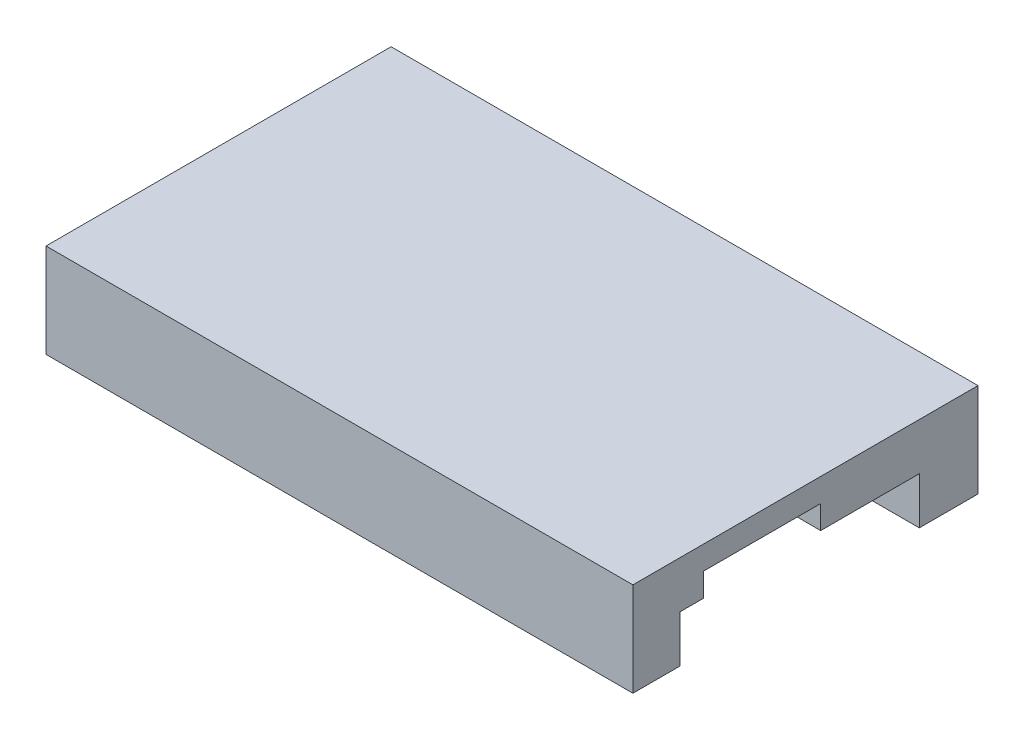
ISO-10303-21;
HEADER;
FILE_DESCRIPTION(('STEP AP214'),'2;1');
FILE_NAME('part.step','',(''),(''),'','','');
FILE_SCHEMA(('AUTOMOTIVE_DESIGN { 1 0 10303 214 1 1 1 1 }'));
ENDSEC;
DATA;
#1=APPLICATION_CONTEXT('core data for automotive mechanical design processes');
#2=APPLICATION_PROTOCOL_DEFINITION('international standard','automotive_design',2000,#1);
#3=PRODUCT_CONTEXT('',#1,'mechanical');
#4=PRODUCT('Part','Part','',(#3));
#5=PRODUCT_RELATED_PRODUCT_CATEGORY('part','',(#4));
#6=PRODUCT_DEFINITION_FORMATION('','',#4);
#7=PRODUCT_DEFINITION_CONTEXT('part definition',#1,'design');
#8=PRODUCT_DEFINITION('design','',#6,#7);
#9=PRODUCT_DEFINITION_SHAPE('','',#8);
#10=(LENGTH_UNIT() NAMED_UNIT(*) SI_UNIT(.MILLI.,.METRE.));
#11=(NAMED_UNIT(*) PLANE_ANGLE_UNIT() SI_UNIT($,.RADIAN.));
#12=(NAMED_UNIT(*) SI_UNIT($,.STERADIAN.) SOLID_ANGLE_UNIT());
#13=UNCERTAINTY_MEASURE_WITH_UNIT(LENGTH_MEASURE(1.E-05),#10,'distance_accuracy_value','');
#14=(GEOMETRIC_REPRESENTATION_CONTEXT(3) GLOBAL_UNCERTAINTY_ASSIGNED_CONTEXT((#13)) GLOBAL_UNIT_ASSIGNED_CONTEXT((#10,
#11,#12)) REPRESENTATION_CONTEXT('',''));
#15=CARTESIAN_POINT('',(0.,0.,0.));
#16=DIRECTION('',(0.,0.,1.));
#17=DIRECTION('',(1.,0.,0.));
#18=AXIS2_PLACEMENT_3D('',#15,#16,#17);
#19=CARTESIAN_POINT('',(0.,-1.,0.));
#20=DIRECTION('',(0.,-1.,0.));
#21=DIRECTION('',(0.,0.,-1.));
#22=AXIS2_PLACEMENT_3D('',#19,#20,#21);
#23=PLANE('',#22);
#24=DIRECTION('',(0.,0.,-1.));
#25=VECTOR('',#24,1.);
#26=CARTESIAN_POINT('',(-19.9854887738261,-1.,0.));
#27=LINE('',#26,#25);
#28=CARTESIAN_POINT('',(-19.9854887738261,-1.,-7.25654754169675));
#29=VERTEX_POINT('',#28);
#30=CARTESIAN_POINT('',(-19.9854887738261,-1.,-8.25654754169675));
#31=VERTEX_POINT('',#30);
#32=EDGE_CURVE('E276',#29,#31,#27,.T.);
#33=ORIENTED_EDGE('',*,*,#32,.F.);
#34=DIRECTION('',(1.,0.,0.));
#35=VECTOR('',#34,1.);
#36=CARTESIAN_POINT('',(0.,-1.,-7.25654754169675));
#37=LINE('',#36,#35);
#38=CARTESIAN_POINT('',(-42.4854887738261,-1.,-7.25654754169675));
#39=VERTEX_POINT('',#38);
#40=EDGE_CURVE('E242',#39,#29,#37,.T.);
#41=ORIENTED_EDGE('',*,*,#40,.F.);
#42=DIRECTION('',(0.,0.,-1.));
#43=VECTOR('',#42,1.);
#44=CARTESIAN_POINT('',(-42.4854887738261,-1.,0.));
#45=LINE('',#44,#43);
#46=CARTESIAN_POINT('',(-42.4854887738261,-1.,-7.75654754169675));
#47=VERTEX_POINT('',#46);
#48=EDGE_CURVE('E327',#39,#47,#45,.T.);
#49=ORIENTED_EDGE('',*,*,#48,.T.);
#50=DIRECTION('',(1.,0.,0.));
#51=VECTOR('',#50,1.);
#52=CARTESIAN_POINT('',(0.,-1.,-7.75654754169675));
#53=LINE('',#52,#51);
#54=CARTESIAN_POINT('',(-20.4854887738261,-1.,-7.75654754169675));
#55=VERTEX_POINT('',#54);
#56=EDGE_CURVE('E324',#47,#55,#53,.T.);
#57=ORIENTED_EDGE('',*,*,#56,.T.);
#58=DIRECTION('',(0.,0.,-1.));
#59=VECTOR('',#58,1.);
#60=CARTESIAN_POINT('',(-20.4854887738261,-1.,0.));
#61=LINE('',#60,#59);
#62=CARTESIAN_POINT('',(-20.4854887738261,-1.,-8.25654754169675));
#63=VERTEX_POINT('',#62);
#64=EDGE_CURVE('E347',#55,#63,#61,.T.);
#65=ORIENTED_EDGE('',*,*,#64,.T.);
#66=DIRECTION('',(-1.,0.,0.));
#67=VECTOR('',#66,1.);
#68=CARTESIAN_POINT('',(0.,-1.,-8.25654754169675));
#69=LINE('',#68,#67);
#70=EDGE_CURVE('E350',#31,#63,#69,.T.);
#71=ORIENTED_EDGE('',*,*,#70,.F.);
#72=EDGE_LOOP('',(#33,#41,#49,#57,#65,#71));
#73=FACE_BOUND('',#72,.T.);
#74=ADVANCED_FACE('F59',(#73),#23,.T.);
#75=CARTESIAN_POINT('',(0.,0.,0.));
#76=DIRECTION('',(0.,1.,0.));
#77=DIRECTION('',(0.,0.,1.));
#78=AXIS2_PLACEMENT_3D('',#75,#76,#77);
#79=PLANE('',#78);
#80=DIRECTION('',(1.,0.,0.));
#81=VECTOR('',#80,1.);
#82=CARTESIAN_POINT('',(0.,0.,-7.75654754169675));
#83=LINE('',#82,#81);
#84=CARTESIAN_POINT('',(-42.4854887738261,0.,-7.75654754169675));
#85=VERTEX_POINT('',#84);
#86=CARTESIAN_POINT('',(-20.4854887738261,0.,-7.75654754169675));
#87=VERTEX_POINT('',#86);
#88=EDGE_CURVE('E331',#85,#87,#83,.T.);
#89=ORIENTED_EDGE('',*,*,#88,.F.);
#90=DIRECTION('',(0.,0.,1.));
#91=VECTOR('',#90,1.);
#92=CARTESIAN_POINT('',(-42.4854887738261,0.,-20.9565475416968));
#93=LINE('',#92,#91);
#94=CARTESIAN_POINT('',(-42.4854887738261,0.,-10.9565475416967));
#95=VERTEX_POINT('',#94);
#96=EDGE_CURVE('E436',#95,#85,#93,.T.);
#97=ORIENTED_EDGE('',*,*,#96,.F.);
#98=DIRECTION('',(1.,0.,0.));
#99=VECTOR('',#98,1.);
#100=CARTESIAN_POINT('',(-42.4854887738261,0.,-10.9565475416967));
#101=LINE('',#100,#99);
#102=CARTESIAN_POINT('',(-37.4854887738261,0.,-10.9565475416967));
#103=VERTEX_POINT('',#102);
#104=EDGE_CURVE('E414',#95,#103,#101,.T.);
#105=ORIENTED_EDGE('',*,*,#104,.T.);
#106=DIRECTION('',(0.,0.,-1.));
#107=VECTOR('',#106,1.);
#108=CARTESIAN_POINT('',(-37.4854887738261,0.,-18.2565475416967));
#109=LINE('',#108,#107);
#110=CARTESIAN_POINT('',(-37.4854887738261,0.,-18.2565475416967));
#111=VERTEX_POINT('',#110);
#112=EDGE_CURVE('E417',#103,#111,#109,.T.);
#113=ORIENTED_EDGE('',*,*,#112,.T.);
#114=DIRECTION('',(-1.,0.,0.));
#115=VECTOR('',#114,1.);
#116=CARTESIAN_POINT('',(-42.4854887738261,0.,-18.2565475416967));
#117=LINE('',#116,#115);
#118=CARTESIAN_POINT('',(-42.4854887738261,0.,-18.2565475416967));
#119=VERTEX_POINT('',#118);
#120=EDGE_CURVE('E393',#111,#119,#117,.T.);
#121=ORIENTED_EDGE('',*,*,#120,.T.);
#122=CARTESIAN_POINT('',(-42.4854887738261,0.,-19.4565475416967));
#123=VERTEX_POINT('',#122);
#124=EDGE_CURVE('E440',#123,#119,#93,.T.);
#125=ORIENTED_EDGE('',*,*,#124,.F.);
#126=DIRECTION('',(1.,0.,0.));
#127=VECTOR('',#126,1.);
#128=CARTESIAN_POINT('',(0.,0.,-19.4565475416967));
#129=LINE('',#128,#127);
#130=CARTESIAN_POINT('',(-20.4854887738261,0.,-19.4565475416967));
#131=VERTEX_POINT('',#130);
#132=EDGE_CURVE('E372',#123,#131,#129,.T.);
#133=ORIENTED_EDGE('',*,*,#132,.T.);
#134=DIRECTION('',(0.,0.,1.));
#135=VECTOR('',#134,1.);
#136=CARTESIAN_POINT('',(-20.4854887738261,0.,0.));
#137=LINE('',#136,#135);
#138=CARTESIAN_POINT('',(-20.4854887738261,0.,-18.4565475416968));
#139=VERTEX_POINT('',#138);
#140=EDGE_CURVE('E343',#131,#139,#137,.T.);
#141=ORIENTED_EDGE('',*,*,#140,.T.);
#142=DIRECTION('',(-1.,0.,0.));
#143=VECTOR('',#142,1.);
#144=CARTESIAN_POINT('',(0.,0.,-18.4565475416968));
#145=LINE('',#144,#143);
#146=CARTESIAN_POINT('',(-17.4854887738261,0.,-18.4565475416968));
#147=VERTEX_POINT('',#146);
#148=EDGE_CURVE('E363',#147,#139,#145,.T.);
#149=ORIENTED_EDGE('',*,*,#148,.F.);
#150=DIRECTION('',(0.,0.,-1.));
#151=VECTOR('',#150,1.);
#152=CARTESIAN_POINT('',(-17.4854887738261,0.,-20.9565475416968));
#153=LINE('',#152,#151);
#154=CARTESIAN_POINT('',(-17.4854887738261,0.,-14.2565475416967));
#155=VERTEX_POINT('',#154);
#156=EDGE_CURVE('E455',#155,#147,#153,.T.);
#157=ORIENTED_EDGE('',*,*,#156,.F.);
#158=DIRECTION('',(-1.,0.,0.));
#159=VECTOR('',#158,1.);
#160=CARTESIAN_POINT('',(-17.4854887738261,0.,-14.2565475416967));
#161=LINE('',#160,#159);
#162=CARTESIAN_POINT('',(-24.9854887738261,0.,-14.2565475416967));
#163=VERTEX_POINT('',#162);
#164=EDGE_CURVE('E400',#155,#163,#161,.T.);
#165=ORIENTED_EDGE('',*,*,#164,.T.);
#166=DIRECTION('',(0.,0.,1.));
#167=VECTOR('',#166,1.);
#168=CARTESIAN_POINT('',(-24.9854887738261,0.,-14.2565475416967));
#169=LINE('',#168,#167);
#170=CARTESIAN_POINT('',(-24.9854887738261,0.,-9.25654754169675));
#171=VERTEX_POINT('',#170);
#172=EDGE_CURVE('E490',#163,#171,#169,.T.);
#173=ORIENTED_EDGE('',*,*,#172,.T.);
#174=DIRECTION('',(1.,0.,0.));
#175=VECTOR('',#174,1.);
#176=CARTESIAN_POINT('',(-17.4854887738261,0.,-9.25654754169675));
#177=LINE('',#176,#175);
#178=CARTESIAN_POINT('',(-17.4854887738261,0.,-9.25654754169675));
#179=VERTEX_POINT('',#178);
#180=EDGE_CURVE('E492',#171,#179,#177,.T.);
#181=ORIENTED_EDGE('',*,*,#180,.T.);
#182=CARTESIAN_POINT('',(-17.4854887738261,0.,-8.25654754169675));
#183=VERTEX_POINT('',#182);
#184=EDGE_CURVE('E450',#183,#179,#153,.T.);
#185=ORIENTED_EDGE('',*,*,#184,.F.);
#186=DIRECTION('',(-1.,0.,0.));
#187=VECTOR('',#186,1.);
#188=CARTESIAN_POINT('',(0.,0.,-8.25654754169675));
#189=LINE('',#188,#187);
#190=CARTESIAN_POINT('',(-20.4854887738261,0.,-8.25654754169675));
#191=VERTEX_POINT('',#190);
#192=EDGE_CURVE('E344',#183,#191,#189,.T.);
#193=ORIENTED_EDGE('',*,*,#192,.T.);
#194=DIRECTION('',(0.,0.,-1.));
#195=VECTOR('',#194,1.);
#196=CARTESIAN_POINT('',(-20.4854887738261,0.,0.));
#197=LINE('',#196,#195);
#198=EDGE_CURVE('E340',#87,#191,#197,.T.);
#199=ORIENTED_EDGE('',*,*,#198,.F.);
#200=EDGE_LOOP('',(#89,#97,#105,#113,#121,#125,#133,#141,#149,#157,#165,#173,#181,#185,#193,#199));
#201=FACE_BOUND('',#200,.T.);
#202=ADVANCED_FACE('F479',(#201),#79,.F.);
#203=CARTESIAN_POINT('',(-42.4854887738261,1.,-20.9565475416968));
#204=DIRECTION('',(1.,0.,0.));
#205=DIRECTION('',(0.,0.,-1.));
#206=AXIS2_PLACEMENT_3D('',#203,#204,#205);
#207=PLANE('',#206);
#208=DIRECTION('',(0.,-1.,0.));
#209=VECTOR('',#208,1.);
#210=CARTESIAN_POINT('',(-42.4854887738261,1.,-6.25654754169675));
#211=LINE('',#210,#209);
#212=CARTESIAN_POINT('',(-42.4854887738261,2.,-6.25654754169675));
#213=VERTEX_POINT('',#212);
#214=CARTESIAN_POINT('',(-42.4854887738261,-2.,-6.25654754169675));
#215=VERTEX_POINT('',#214);
#216=EDGE_CURVE('E12',#213,#215,#211,.T.);
#217=ORIENTED_EDGE('',*,*,#216,.F.);
#218=DIRECTION('',(0.,0.,1.));
#219=VECTOR('',#218,1.);
#220=CARTESIAN_POINT('',(-42.4854887738261,2.,-6.25654754169675));
#221=LINE('',#220,#219);
#222=CARTESIAN_POINT('',(-42.4854887738261,2.,-20.9565475416968));
#223=VERTEX_POINT('',#222);
#224=EDGE_CURVE('E307',#223,#213,#221,.T.);
#225=ORIENTED_EDGE('',*,*,#224,.F.);
#226=DIRECTION('',(0.,-1.,0.));
#227=VECTOR('',#226,1.);
#228=CARTESIAN_POINT('',(-42.4854887738261,1.,-20.9565475416968));
#229=LINE('',#228,#227);
#230=CARTESIAN_POINT('',(-42.4854887738261,-2.,-20.9565475416968));
#231=VERTEX_POINT('',#230);
#232=EDGE_CURVE('E515',#223,#231,#229,.T.);
#233=ORIENTED_EDGE('',*,*,#232,.T.);
#234=DIRECTION('',(0.,0.,1.));
#235=VECTOR('',#234,1.);
#236=CARTESIAN_POINT('',(-42.4854887738261,-2.,0.));
#237=LINE('',#236,#235);
#238=CARTESIAN_POINT('',(-42.4854887738261,-2.,-19.9565475416967));
#239=VERTEX_POINT('',#238);
#240=EDGE_CURVE('E257',#231,#239,#237,.T.);
#241=ORIENTED_EDGE('',*,*,#240,.T.);
#242=DIRECTION('',(0.,1.,0.));
#243=VECTOR('',#242,1.);
#244=CARTESIAN_POINT('',(-42.4854887738261,-2.,-19.9565475416967));
#245=LINE('',#244,#243);
#246=CARTESIAN_POINT('',(-42.4854887738261,-1.,-19.9565475416967));
#247=VERTEX_POINT('',#246);
#248=EDGE_CURVE('E243',#239,#247,#245,.T.);
#249=ORIENTED_EDGE('',*,*,#248,.T.);
#250=DIRECTION('',(0.,0.,-1.));
#251=VECTOR('',#250,1.);
#252=CARTESIAN_POINT('',(-42.4854887738261,-1.,0.));
#253=LINE('',#252,#251);
#254=CARTESIAN_POINT('',(-42.4854887738261,-1.,-19.4565475416967));
#255=VERTEX_POINT('',#254);
#256=EDGE_CURVE('E81',#255,#247,#253,.T.);
#257=ORIENTED_EDGE('',*,*,#256,.F.);
#258=DIRECTION('',(0.,1.,0.));
#259=VECTOR('',#258,1.);
#260=CARTESIAN_POINT('',(-42.4854887738261,-1.,-19.4565475416967));
#261=LINE('',#260,#259);
#262=EDGE_CURVE('E459',#255,#123,#261,.T.);
#263=ORIENTED_EDGE('',*,*,#262,.T.);
#264=ORIENTED_EDGE('',*,*,#124,.T.);
#265=DIRECTION('',(0.,1.,0.));
#266=VECTOR('',#265,1.);
#267=CARTESIAN_POINT('',(-42.4854887738261,0.,-18.2565475416967));
#268=LINE('',#267,#266);
#269=CARTESIAN_POINT('',(-42.4854887738261,1.,-18.2565475416967));
#270=VERTEX_POINT('',#269);
#271=EDGE_CURVE('E434',#119,#270,#268,.T.);
#272=ORIENTED_EDGE('',*,*,#271,.T.);
#273=DIRECTION('',(0.,0.,1.));
#274=VECTOR('',#273,1.);
#275=CARTESIAN_POINT('',(-42.4854887738261,1.,-6.25654754169675));
#276=LINE('',#275,#274);
#277=CARTESIAN_POINT('',(-42.4854887738261,1.,-10.9565475416967));
#278=VERTEX_POINT('',#277);
#279=EDGE_CURVE('E304',#270,#278,#276,.T.);
#280=ORIENTED_EDGE('',*,*,#279,.T.);
#281=DIRECTION('',(0.,1.,0.));
#282=VECTOR('',#281,1.);
#283=CARTESIAN_POINT('',(-42.4854887738261,0.,-10.9565475416967));
#284=LINE('',#283,#282);
#285=EDGE_CURVE('E389',#95,#278,#284,.T.);
#286=ORIENTED_EDGE('',*,*,#285,.F.);
#287=ORIENTED_EDGE('',*,*,#96,.T.);
#288=DIRECTION('',(0.,1.,0.));
#289=VECTOR('',#288,1.);
#290=CARTESIAN_POINT('',(-42.4854887738261,-1.,-7.75654754169675));
#291=LINE('',#290,#289);
#292=EDGE_CURVE('E313',#47,#85,#291,.T.);
#293=ORIENTED_EDGE('',*,*,#292,.F.);
#294=ORIENTED_EDGE('',*,*,#48,.F.);
#295=DIRECTION('',(0.,1.,0.));
#296=VECTOR('',#295,1.);
#297=CARTESIAN_POINT('',(-42.4854887738261,-2.,-7.25654754169675));
#298=LINE('',#297,#296);
#299=CARTESIAN_POINT('',(-42.4854887738261,-2.,-7.25654754169675));
#300=VERTEX_POINT('',#299);
#301=EDGE_CURVE('E289',#300,#39,#298,.T.);
#302=ORIENTED_EDGE('',*,*,#301,.F.);
#303=DIRECTION('',(0.,0.,-1.));
#304=VECTOR('',#303,1.);
#305=CARTESIAN_POINT('',(-42.4854887738261,-2.,0.));
#306=LINE('',#305,#304);
#307=EDGE_CURVE('E287',#215,#300,#306,.T.);
#308=ORIENTED_EDGE('',*,*,#307,.F.);
#309=EDGE_LOOP('',(#217,#225,#233,#241,#249,#257,#263,#264,#272,#280,#286,#287,#293,#294,#302,#308));
#310=FACE_BOUND('',#309,.T.);
#311=ADVANCED_FACE('F61',(#310),#207,.F.);
#312=CARTESIAN_POINT('',(-42.4854887738261,1.,-6.25654754169675));
#313=DIRECTION('',(0.,0.,-1.));
#314=DIRECTION('',(-1.,0.,0.));
#315=AXIS2_PLACEMENT_3D('',#312,#313,#314);
#316=PLANE('',#315);
#317=ORIENTED_EDGE('',*,*,#216,.T.);
#318=DIRECTION('',(-1.,0.,0.));
#319=VECTOR('',#318,1.);
#320=CARTESIAN_POINT('',(0.,-2.,-6.25654754169675));
#321=LINE('',#320,#319);
#322=CARTESIAN_POINT('',(-17.4854887738261,-2.,-6.25654754169675));
#323=VERTEX_POINT('',#322);
#324=EDGE_CURVE('E284',#323,#215,#321,.T.);
#325=ORIENTED_EDGE('',*,*,#324,.F.);
#326=DIRECTION('',(0.,-1.,0.));
#327=VECTOR('',#326,1.);
#328=CARTESIAN_POINT('',(-17.4854887738261,1.,-6.25654754169675));
#329=LINE('',#328,#327);
#330=CARTESIAN_POINT('',(-17.4854887738261,2.,-6.25654754169675));
#331=VERTEX_POINT('',#330);
#332=EDGE_CURVE('E68',#331,#323,#329,.T.);
#333=ORIENTED_EDGE('',*,*,#332,.F.);
#334=DIRECTION('',(1.,0.,0.));
#335=VECTOR('',#334,1.);
#336=CARTESIAN_POINT('',(-17.4854887738261,2.,-6.25654754169675));
#337=LINE('',#336,#335);
#338=EDGE_CURVE('E310',#213,#331,#337,.T.);
#339=ORIENTED_EDGE('',*,*,#338,.F.);
#340=EDGE_LOOP('',(#317,#325,#333,#339));
#341=FACE_BOUND('',#340,.T.);
#342=ADVANCED_FACE('F528',(#341),#316,.F.);
#343=CARTESIAN_POINT('',(-17.4854887738261,1.,-20.9565475416968));
#344=DIRECTION('',(-1.,0.,0.));
#345=DIRECTION('',(0.,0.,1.));
#346=AXIS2_PLACEMENT_3D('',#343,#344,#345);
#347=PLANE('',#346);
#348=DIRECTION('',(0.,-1.,0.));
#349=VECTOR('',#348,1.);
#350=CARTESIAN_POINT('',(-17.4854887738261,1.,-20.9565475416968));
#351=LINE('',#350,#349);
#352=CARTESIAN_POINT('',(-17.4854887738261,2.,-20.9565475416968));
#353=VERTEX_POINT('',#352);
#354=CARTESIAN_POINT('',(-17.4854887738261,-2.,-20.9565475416968));
#355=VERTEX_POINT('',#354);
#356=EDGE_CURVE('E516',#353,#355,#351,.T.);
#357=ORIENTED_EDGE('',*,*,#356,.F.);
#358=DIRECTION('',(0.,0.,-1.));
#359=VECTOR('',#358,1.);
#360=CARTESIAN_POINT('',(-17.4854887738261,2.,-6.25654754169675));
#361=LINE('',#360,#359);
#362=EDGE_CURVE('E300',#331,#353,#361,.T.);
#363=ORIENTED_EDGE('',*,*,#362,.F.);
#364=ORIENTED_EDGE('',*,*,#332,.T.);
#365=DIRECTION('',(0.,0.,1.));
#366=VECTOR('',#365,1.);
#367=CARTESIAN_POINT('',(-17.4854887738261,-2.,0.));
#368=LINE('',#367,#366);
#369=CARTESIAN_POINT('',(-17.4854887738261,-2.,-8.25654754169675));
#370=VERTEX_POINT('',#369);
#371=EDGE_CURVE('E281',#370,#323,#368,.T.);
#372=ORIENTED_EDGE('',*,*,#371,.F.);
#373=DIRECTION('',(0.,1.,0.));
#374=VECTOR('',#373,1.);
#375=CARTESIAN_POINT('',(-17.4854887738261,-1.,-8.25654754169675));
#376=LINE('',#375,#374);
#377=EDGE_CURVE('E352',#370,#183,#376,.T.);
#378=ORIENTED_EDGE('',*,*,#377,.T.);
#379=ORIENTED_EDGE('',*,*,#184,.T.);
#380=DIRECTION('',(0.,1.,0.));
#381=VECTOR('',#380,1.);
#382=CARTESIAN_POINT('',(-17.4854887738261,0.,-9.25654754169675));
#383=LINE('',#382,#381);
#384=CARTESIAN_POINT('',(-17.4854887738261,1.,-9.25654754169675));
#385=VERTEX_POINT('',#384);
#386=EDGE_CURVE('E386',#179,#385,#383,.T.);
#387=ORIENTED_EDGE('',*,*,#386,.T.);
#388=DIRECTION('',(0.,0.,-1.));
#389=VECTOR('',#388,1.);
#390=CARTESIAN_POINT('',(-17.4854887738261,1.,-6.25654754169675));
#391=LINE('',#390,#389);
#392=CARTESIAN_POINT('',(-17.4854887738261,1.,-14.2565475416967));
#393=VERTEX_POINT('',#392);
#394=EDGE_CURVE('E299',#385,#393,#391,.T.);
#395=ORIENTED_EDGE('',*,*,#394,.T.);
#396=DIRECTION('',(0.,1.,0.));
#397=VECTOR('',#396,1.);
#398=CARTESIAN_POINT('',(-17.4854887738261,0.,-14.2565475416967));
#399=LINE('',#398,#397);
#400=EDGE_CURVE('E413',#155,#393,#399,.T.);
#401=ORIENTED_EDGE('',*,*,#400,.F.);
#402=ORIENTED_EDGE('',*,*,#156,.T.);
#403=DIRECTION('',(0.,1.,0.));
#404=VECTOR('',#403,1.);
#405=CARTESIAN_POINT('',(-17.4854887738261,-1.,-18.4565475416968));
#406=LINE('',#405,#404);
#407=CARTESIAN_POINT('',(-17.4854887738261,-2.,-18.4565475416968));
#408=VERTEX_POINT('',#407);
#409=EDGE_CURVE('E462',#408,#147,#406,.T.);
#410=ORIENTED_EDGE('',*,*,#409,.F.);
#411=DIRECTION('',(0.,0.,1.));
#412=VECTOR('',#411,1.);
#413=CARTESIAN_POINT('',(-17.4854887738261,-2.,0.));
#414=LINE('',#413,#412);
#415=EDGE_CURVE('E264',#355,#408,#414,.T.);
#416=ORIENTED_EDGE('',*,*,#415,.F.);
#417=EDGE_LOOP('',(#357,#363,#364,#372,#378,#379,#387,#395,#401,#402,#410,#416));
#418=FACE_BOUND('',#417,.T.);
#419=ADVANCED_FACE('F505',(#418),#347,.F.);
#420=CARTESIAN_POINT('',(-42.4854887738261,1.,-20.9565475416968));
#421=DIRECTION('',(0.,0.,1.));
#422=DIRECTION('',(1.,0.,0.));
#423=AXIS2_PLACEMENT_3D('',#420,#421,#422);
#424=PLANE('',#423);
#425=ORIENTED_EDGE('',*,*,#356,.T.);
#426=DIRECTION('',(1.,0.,0.));
#427=VECTOR('',#426,1.);
#428=CARTESIAN_POINT('',(0.,-2.,-20.9565475416968));
#429=LINE('',#428,#427);
#430=EDGE_CURVE('E259',#231,#355,#429,.T.);
#431=ORIENTED_EDGE('',*,*,#430,.F.);
#432=ORIENTED_EDGE('',*,*,#232,.F.);
#433=DIRECTION('',(-1.,0.,0.));
#434=VECTOR('',#433,1.);
#435=CARTESIAN_POINT('',(-17.4854887738261,2.,-20.9565475416968));
#436=LINE('',#435,#434);
#437=EDGE_CURVE('E303',#353,#223,#436,.T.);
#438=ORIENTED_EDGE('',*,*,#437,.F.);
#439=EDGE_LOOP('',(#425,#431,#432,#438));
#440=FACE_BOUND('',#439,.T.);
#441=ADVANCED_FACE('F534',(#440),#424,.F.);
#442=CARTESIAN_POINT('',(-42.4854887738261,0.,-18.2565475416967));
#443=DIRECTION('',(0.,0.,-1.));
#444=DIRECTION('',(-1.,0.,0.));
#445=AXIS2_PLACEMENT_3D('',#442,#443,#444);
#446=PLANE('',#445);
#447=DIRECTION('',(-1.,0.,0.));
#448=VECTOR('',#447,1.);
#449=CARTESIAN_POINT('',(-42.4854887738261,1.,-18.2565475416967));
#450=LINE('',#449,#448);
#451=CARTESIAN_POINT('',(-37.4854887738261,1.,-18.2565475416967));
#452=VERTEX_POINT('',#451);
#453=EDGE_CURVE('E418',#452,#270,#450,.T.);
#454=ORIENTED_EDGE('',*,*,#453,.T.);
#455=ORIENTED_EDGE('',*,*,#271,.F.);
#456=ORIENTED_EDGE('',*,*,#120,.F.);
#457=DIRECTION('',(0.,1.,0.));
#458=VECTOR('',#457,1.);
#459=CARTESIAN_POINT('',(-37.4854887738261,0.,-18.2565475416967));
#460=LINE('',#459,#458);
#461=EDGE_CURVE('E427',#111,#452,#460,.T.);
#462=ORIENTED_EDGE('',*,*,#461,.T.);
#463=EDGE_LOOP('',(#454,#455,#456,#462));
#464=FACE_BOUND('',#463,.T.);
#465=ADVANCED_FACE('F689',(#464),#446,.F.);
#466=CARTESIAN_POINT('',(-37.4854887738261,0.,-18.2565475416967));
#467=DIRECTION('',(1.,0.,0.));
#468=DIRECTION('',(0.,0.,-1.));
#469=AXIS2_PLACEMENT_3D('',#466,#467,#468);
#470=PLANE('',#469);
#471=DIRECTION('',(0.,0.,-1.));
#472=VECTOR('',#471,1.);
#473=CARTESIAN_POINT('',(-37.4854887738261,1.,-18.2565475416967));
#474=LINE('',#473,#472);
#475=CARTESIAN_POINT('',(-37.4854887738261,1.,-10.9565475416967));
#476=VERTEX_POINT('',#475);
#477=EDGE_CURVE('E385',#476,#452,#474,.T.);
#478=ORIENTED_EDGE('',*,*,#477,.T.);
#479=ORIENTED_EDGE('',*,*,#461,.F.);
#480=ORIENTED_EDGE('',*,*,#112,.F.);
#481=DIRECTION('',(0.,1.,0.));
#482=VECTOR('',#481,1.);
#483=CARTESIAN_POINT('',(-37.4854887738261,0.,-10.9565475416967));
#484=LINE('',#483,#482);
#485=EDGE_CURVE('E392',#103,#476,#484,.T.);
#486=ORIENTED_EDGE('',*,*,#485,.T.);
#487=EDGE_LOOP('',(#478,#479,#480,#486));
#488=FACE_BOUND('',#487,.T.);
#489=ADVANCED_FACE('F696',(#488),#470,.F.);
#490=CARTESIAN_POINT('',(-42.4854887738261,0.,-10.9565475416967));
#491=DIRECTION('',(0.,0.,1.));
#492=DIRECTION('',(1.,0.,0.));
#493=AXIS2_PLACEMENT_3D('',#490,#491,#492);
#494=PLANE('',#493);
#495=DIRECTION('',(1.,0.,0.));
#496=VECTOR('',#495,1.);
#497=CARTESIAN_POINT('',(-42.4854887738261,1.,-10.9565475416967));
#498=LINE('',#497,#496);
#499=EDGE_CURVE('E382',#278,#476,#498,.T.);
#500=ORIENTED_EDGE('',*,*,#499,.T.);
#501=ORIENTED_EDGE('',*,*,#485,.F.);
#502=ORIENTED_EDGE('',*,*,#104,.F.);
#503=ORIENTED_EDGE('',*,*,#285,.T.);
#504=EDGE_LOOP('',(#500,#501,#502,#503));
#505=FACE_BOUND('',#504,.T.);
#506=ADVANCED_FACE('F703',(#505),#494,.F.);
#507=CARTESIAN_POINT('',(-17.4854887738261,0.,-9.25654754169675));
#508=DIRECTION('',(0.,0.,1.));
#509=DIRECTION('',(1.,0.,0.));
#510=AXIS2_PLACEMENT_3D('',#507,#508,#509);
#511=PLANE('',#510);
#512=DIRECTION('',(1.,0.,0.));
#513=VECTOR('',#512,1.);
#514=CARTESIAN_POINT('',(-17.4854887738261,1.,-9.25654754169675));
#515=LINE('',#514,#513);
#516=CARTESIAN_POINT('',(-24.9854887738261,1.,-9.25654754169675));
#517=VERTEX_POINT('',#516);
#518=EDGE_CURVE('E396',#517,#385,#515,.T.);
#519=ORIENTED_EDGE('',*,*,#518,.T.);
#520=ORIENTED_EDGE('',*,*,#386,.F.);
#521=ORIENTED_EDGE('',*,*,#180,.F.);
#522=DIRECTION('',(0.,1.,0.));
#523=VECTOR('',#522,1.);
#524=CARTESIAN_POINT('',(-24.9854887738261,0.,-9.25654754169675));
#525=LINE('',#524,#523);
#526=EDGE_CURVE('E407',#171,#517,#525,.T.);
#527=ORIENTED_EDGE('',*,*,#526,.T.);
#528=EDGE_LOOP('',(#519,#520,#521,#527));
#529=FACE_BOUND('',#528,.T.);
#530=ADVANCED_FACE('F512',(#529),#511,.F.);
#531=CARTESIAN_POINT('',(-24.9854887738261,0.,-14.2565475416967));
#532=DIRECTION('',(-1.,0.,0.));
#533=DIRECTION('',(0.,0.,1.));
#534=AXIS2_PLACEMENT_3D('',#531,#532,#533);
#535=PLANE('',#534);
#536=DIRECTION('',(0.,0.,1.));
#537=VECTOR('',#536,1.);
#538=CARTESIAN_POINT('',(-24.9854887738261,1.,-14.2565475416967));
#539=LINE('',#538,#537);
#540=CARTESIAN_POINT('',(-24.9854887738261,1.,-14.2565475416967));
#541=VERTEX_POINT('',#540);
#542=EDGE_CURVE('E401',#541,#517,#539,.T.);
#543=ORIENTED_EDGE('',*,*,#542,.T.);
#544=ORIENTED_EDGE('',*,*,#526,.F.);
#545=ORIENTED_EDGE('',*,*,#172,.F.);
#546=DIRECTION('',(0.,1.,0.));
#547=VECTOR('',#546,1.);
#548=CARTESIAN_POINT('',(-24.9854887738261,0.,-14.2565475416967));
#549=LINE('',#548,#547);
#550=EDGE_CURVE('E410',#163,#541,#549,.T.);
#551=ORIENTED_EDGE('',*,*,#550,.T.);
#552=EDGE_LOOP('',(#543,#544,#545,#551));
#553=FACE_BOUND('',#552,.T.);
#554=ADVANCED_FACE('F509',(#553),#535,.F.);
#555=CARTESIAN_POINT('',(-17.4854887738261,0.,-14.2565475416967));
#556=DIRECTION('',(0.,0.,-1.));
#557=DIRECTION('',(-1.,0.,0.));
#558=AXIS2_PLACEMENT_3D('',#555,#556,#557);
#559=PLANE('',#558);
#560=DIRECTION('',(-1.,0.,0.));
#561=VECTOR('',#560,1.);
#562=CARTESIAN_POINT('',(-17.4854887738261,1.,-14.2565475416967));
#563=LINE('',#562,#561);
#564=EDGE_CURVE('E484',#393,#541,#563,.T.);
#565=ORIENTED_EDGE('',*,*,#564,.T.);
#566=ORIENTED_EDGE('',*,*,#550,.F.);
#567=ORIENTED_EDGE('',*,*,#164,.F.);
#568=ORIENTED_EDGE('',*,*,#400,.T.);
#569=EDGE_LOOP('',(#565,#566,#567,#568));
#570=FACE_BOUND('',#569,.T.);
#571=ADVANCED_FACE('F502',(#570),#559,.F.);
#572=CARTESIAN_POINT('',(-20.4854887738261,-1.,0.));
#573=DIRECTION('',(-1.,0.,0.));
#574=DIRECTION('',(0.,0.,1.));
#575=AXIS2_PLACEMENT_3D('',#572,#573,#574);
#576=PLANE('',#575);
#577=ORIENTED_EDGE('',*,*,#140,.F.);
#578=DIRECTION('',(0.,1.,0.));
#579=VECTOR('',#578,1.);
#580=CARTESIAN_POINT('',(-20.4854887738261,-1.,-19.4565475416967));
#581=LINE('',#580,#579);
#582=CARTESIAN_POINT('',(-20.4854887738261,-1.,-19.4565475416967));
#583=VERTEX_POINT('',#582);
#584=EDGE_CURVE('E461',#583,#131,#581,.T.);
#585=ORIENTED_EDGE('',*,*,#584,.F.);
#586=DIRECTION('',(0.,0.,1.));
#587=VECTOR('',#586,1.);
#588=CARTESIAN_POINT('',(-20.4854887738261,-1.,0.));
#589=LINE('',#588,#587);
#590=CARTESIAN_POINT('',(-20.4854887738261,-1.,-18.4565475416968));
#591=VERTEX_POINT('',#590);
#592=EDGE_CURVE('E359',#583,#591,#589,.T.);
#593=ORIENTED_EDGE('',*,*,#592,.T.);
#594=DIRECTION('',(0.,1.,0.));
#595=VECTOR('',#594,1.);
#596=CARTESIAN_POINT('',(-20.4854887738261,-1.,-18.4565475416968));
#597=LINE('',#596,#595);
#598=EDGE_CURVE('E369',#591,#139,#597,.T.);
#599=ORIENTED_EDGE('',*,*,#598,.T.);
#600=EDGE_LOOP('',(#577,#585,#593,#599));
#601=FACE_BOUND('',#600,.T.);
#602=ADVANCED_FACE('F472',(#601),#576,.T.);
#603=CARTESIAN_POINT('',(0.,-1.,-19.4565475416967));
#604=DIRECTION('',(0.,0.,1.));
#605=DIRECTION('',(1.,0.,0.));
#606=AXIS2_PLACEMENT_3D('',#603,#604,#605);
#607=PLANE('',#606);
#608=ORIENTED_EDGE('',*,*,#132,.F.);
#609=ORIENTED_EDGE('',*,*,#262,.F.);
#610=DIRECTION('',(1.,0.,0.));
#611=VECTOR('',#610,1.);
#612=CARTESIAN_POINT('',(0.,-1.,-19.4565475416967));
#613=LINE('',#612,#611);
#614=EDGE_CURVE('E362',#255,#583,#613,.T.);
#615=ORIENTED_EDGE('',*,*,#614,.T.);
#616=ORIENTED_EDGE('',*,*,#584,.T.);
#617=EDGE_LOOP('',(#608,#609,#615,#616));
#618=FACE_BOUND('',#617,.T.);
#619=ADVANCED_FACE('F483',(#618),#607,.T.);
#620=CARTESIAN_POINT('',(0.,-1.,-18.4565475416968));
#621=DIRECTION('',(0.,0.,-1.));
#622=DIRECTION('',(-1.,0.,0.));
#623=AXIS2_PLACEMENT_3D('',#620,#621,#622);
#624=PLANE('',#623);
#625=ORIENTED_EDGE('',*,*,#148,.T.);
#626=ORIENTED_EDGE('',*,*,#598,.F.);
#627=DIRECTION('',(-1.,0.,0.));
#628=VECTOR('',#627,1.);
#629=CARTESIAN_POINT('',(0.,-1.,-18.4565475416968));
#630=LINE('',#629,#628);
#631=CARTESIAN_POINT('',(-19.9854887738261,-1.,-18.4565475416968));
#632=VERTEX_POINT('',#631);
#633=EDGE_CURVE('E367',#632,#591,#630,.T.);
#634=ORIENTED_EDGE('',*,*,#633,.F.);
#635=DIRECTION('',(0.,1.,0.));
#636=VECTOR('',#635,1.);
#637=CARTESIAN_POINT('',(-19.9854887738261,-2.,-18.4565475416968));
#638=LINE('',#637,#636);
#639=CARTESIAN_POINT('',(-19.9854887738261,-2.,-18.4565475416968));
#640=VERTEX_POINT('',#639);
#641=EDGE_CURVE('E267',#640,#632,#638,.T.);
#642=ORIENTED_EDGE('',*,*,#641,.F.);
#643=DIRECTION('',(-1.,0.,0.));
#644=VECTOR('',#643,1.);
#645=CARTESIAN_POINT('',(0.,-2.,-18.4565475416968));
#646=LINE('',#645,#644);
#647=EDGE_CURVE('E253',#408,#640,#646,.T.);
#648=ORIENTED_EDGE('',*,*,#647,.F.);
#649=ORIENTED_EDGE('',*,*,#409,.T.);
#650=EDGE_LOOP('',(#625,#626,#634,#642,#648,#649));
#651=FACE_BOUND('',#650,.T.);
#652=ADVANCED_FACE('F475',(#651),#624,.F.);
#653=CARTESIAN_POINT('',(0.,-1.,0.));
#654=DIRECTION('',(0.,-1.,0.));
#655=DIRECTION('',(0.,0.,-1.));
#656=AXIS2_PLACEMENT_3D('',#653,#654,#655);
#657=PLANE('',#656);
#658=DIRECTION('',(0.,0.,1.));
#659=VECTOR('',#658,1.);
#660=CARTESIAN_POINT('',(-19.9854887738261,-1.,0.));
#661=LINE('',#660,#659);
#662=CARTESIAN_POINT('',(-19.9854887738261,-1.,-19.9565475416967));
#663=VERTEX_POINT('',#662);
#664=EDGE_CURVE('E239',#663,#632,#661,.T.);
#665=ORIENTED_EDGE('',*,*,#664,.T.);
#666=ORIENTED_EDGE('',*,*,#633,.T.);
#667=ORIENTED_EDGE('',*,*,#592,.F.);
#668=ORIENTED_EDGE('',*,*,#614,.F.);
#669=ORIENTED_EDGE('',*,*,#256,.T.);
#670=DIRECTION('',(1.,0.,0.));
#671=VECTOR('',#670,1.);
#672=CARTESIAN_POINT('',(0.,-1.,-19.9565475416967));
#673=LINE('',#672,#671);
#674=EDGE_CURVE('E76',#247,#663,#673,.T.);
#675=ORIENTED_EDGE('',*,*,#674,.T.);
#676=EDGE_LOOP('',(#665,#666,#667,#668,#669,#675));
#677=FACE_BOUND('',#676,.T.);
#678=ADVANCED_FACE('F536',(#677),#657,.T.);
#679=CARTESIAN_POINT('',(0.,-1.,-7.75654754169675));
#680=DIRECTION('',(0.,0.,1.));
#681=DIRECTION('',(1.,0.,0.));
#682=AXIS2_PLACEMENT_3D('',#679,#680,#681);
#683=PLANE('',#682);
#684=ORIENTED_EDGE('',*,*,#88,.T.);
#685=DIRECTION('',(0.,1.,0.));
#686=VECTOR('',#685,1.);
#687=CARTESIAN_POINT('',(-20.4854887738261,-1.,-7.75654754169675));
#688=LINE('',#687,#686);
#689=EDGE_CURVE('E328',#55,#87,#688,.T.);
#690=ORIENTED_EDGE('',*,*,#689,.F.);
#691=ORIENTED_EDGE('',*,*,#56,.F.);
#692=ORIENTED_EDGE('',*,*,#292,.T.);
#693=EDGE_LOOP('',(#684,#690,#691,#692));
#694=FACE_BOUND('',#693,.T.);
#695=ADVANCED_FACE('F538',(#694),#683,.F.);
#696=CARTESIAN_POINT('',(0.,-1.,-8.25654754169675));
#697=DIRECTION('',(0.,0.,-1.));
#698=DIRECTION('',(-1.,0.,0.));
#699=AXIS2_PLACEMENT_3D('',#696,#697,#698);
#700=PLANE('',#699);
#701=ORIENTED_EDGE('',*,*,#192,.F.);
#702=ORIENTED_EDGE('',*,*,#377,.F.);
#703=DIRECTION('',(1.,0.,0.));
#704=VECTOR('',#703,1.);
#705=CARTESIAN_POINT('',(0.,-2.,-8.25654754169675));
#706=LINE('',#705,#704);
#707=CARTESIAN_POINT('',(-19.9854887738261,-2.,-8.25654754169675));
#708=VERTEX_POINT('',#707);
#709=EDGE_CURVE('E278',#708,#370,#706,.T.);
#710=ORIENTED_EDGE('',*,*,#709,.F.);
#711=DIRECTION('',(0.,1.,0.));
#712=VECTOR('',#711,1.);
#713=CARTESIAN_POINT('',(-19.9854887738261,-2.,-8.25654754169675));
#714=LINE('',#713,#712);
#715=EDGE_CURVE('E295',#708,#31,#714,.T.);
#716=ORIENTED_EDGE('',*,*,#715,.T.);
#717=ORIENTED_EDGE('',*,*,#70,.T.);
#718=DIRECTION('',(0.,1.,0.));
#719=VECTOR('',#718,1.);
#720=CARTESIAN_POINT('',(-20.4854887738261,-1.,-8.25654754169675));
#721=LINE('',#720,#719);
#722=EDGE_CURVE('E334',#63,#191,#721,.T.);
#723=ORIENTED_EDGE('',*,*,#722,.T.);
#724=EDGE_LOOP('',(#701,#702,#710,#716,#717,#723));
#725=FACE_BOUND('',#724,.T.);
#726=ADVANCED_FACE('F544',(#725),#700,.T.);
#727=CARTESIAN_POINT('',(-20.4854887738261,-1.,0.));
#728=DIRECTION('',(1.,0.,0.));
#729=DIRECTION('',(0.,0.,-1.));
#730=AXIS2_PLACEMENT_3D('',#727,#728,#729);
#731=PLANE('',#730);
#732=ORIENTED_EDGE('',*,*,#198,.T.);
#733=ORIENTED_EDGE('',*,*,#722,.F.);
#734=ORIENTED_EDGE('',*,*,#64,.F.);
#735=ORIENTED_EDGE('',*,*,#689,.T.);
#736=EDGE_LOOP('',(#732,#733,#734,#735));
#737=FACE_BOUND('',#736,.T.);
#738=ADVANCED_FACE('F559',(#737),#731,.F.);
#739=CARTESIAN_POINT('',(0.,1.,0.));
#740=DIRECTION('',(0.,1.,0.));
#741=DIRECTION('',(0.,0.,1.));
#742=AXIS2_PLACEMENT_3D('',#739,#740,#741);
#743=PLANE('',#742);
#744=ORIENTED_EDGE('',*,*,#518,.F.);
#745=ORIENTED_EDGE('',*,*,#542,.F.);
#746=ORIENTED_EDGE('',*,*,#564,.F.);
#747=ORIENTED_EDGE('',*,*,#394,.F.);
#748=EDGE_LOOP('',(#744,#745,#746,#747));
#749=FACE_BOUND('',#748,.T.);
#750=ADVANCED_FACE('F563',(#749),#743,.F.);
#751=CARTESIAN_POINT('',(0.,2.,0.));
#752=DIRECTION('',(0.,1.,0.));
#753=DIRECTION('',(0.,0.,1.));
#754=AXIS2_PLACEMENT_3D('',#751,#752,#753);
#755=PLANE('',#754);
#756=ORIENTED_EDGE('',*,*,#362,.T.);
#757=ORIENTED_EDGE('',*,*,#437,.T.);
#758=ORIENTED_EDGE('',*,*,#224,.T.);
#759=ORIENTED_EDGE('',*,*,#338,.T.);
#760=EDGE_LOOP('',(#756,#757,#758,#759));
#761=FACE_BOUND('',#760,.T.);
#762=ADVANCED_FACE('F531',(#761),#755,.T.);
#763=ORIENTED_EDGE('',*,*,#453,.F.);
#764=ORIENTED_EDGE('',*,*,#477,.F.);
#765=ORIENTED_EDGE('',*,*,#499,.F.);
#766=ORIENTED_EDGE('',*,*,#279,.F.);
#767=EDGE_LOOP('',(#763,#764,#765,#766));
#768=FACE_BOUND('',#767,.T.);
#769=ADVANCED_FACE('F565',(#768),#743,.F.);
#770=CARTESIAN_POINT('',(0.,-2.,-7.25654754169675));
#771=DIRECTION('',(0.,0.,1.));
#772=DIRECTION('',(1.,0.,0.));
#773=AXIS2_PLACEMENT_3D('',#770,#771,#772);
#774=PLANE('',#773);
#775=ORIENTED_EDGE('',*,*,#40,.T.);
#776=DIRECTION('',(0.,1.,0.));
#777=VECTOR('',#776,1.);
#778=CARTESIAN_POINT('',(-19.9854887738261,-2.,-7.25654754169675));
#779=LINE('',#778,#777);
#780=CARTESIAN_POINT('',(-19.9854887738261,-2.,-7.25654754169675));
#781=VERTEX_POINT('',#780);
#782=EDGE_CURVE('E297',#781,#29,#779,.T.);
#783=ORIENTED_EDGE('',*,*,#782,.F.);
#784=DIRECTION('',(1.,0.,0.));
#785=VECTOR('',#784,1.);
#786=CARTESIAN_POINT('',(0.,-2.,-7.25654754169675));
#787=LINE('',#786,#785);
#788=EDGE_CURVE('E272',#300,#781,#787,.T.);
#789=ORIENTED_EDGE('',*,*,#788,.F.);
#790=ORIENTED_EDGE('',*,*,#301,.T.);
#791=EDGE_LOOP('',(#775,#783,#789,#790));
#792=FACE_BOUND('',#791,.T.);
#793=ADVANCED_FACE('F568',(#792),#774,.F.);
#794=CARTESIAN_POINT('',(-19.9854887738261,-2.,0.));
#795=DIRECTION('',(1.,0.,0.));
#796=DIRECTION('',(0.,0.,-1.));
#797=AXIS2_PLACEMENT_3D('',#794,#795,#796);
#798=PLANE('',#797);
#799=ORIENTED_EDGE('',*,*,#32,.T.);
#800=ORIENTED_EDGE('',*,*,#715,.F.);
#801=DIRECTION('',(0.,0.,-1.));
#802=VECTOR('',#801,1.);
#803=CARTESIAN_POINT('',(-19.9854887738261,-2.,0.));
#804=LINE('',#803,#802);
#805=EDGE_CURVE('E275',#781,#708,#804,.T.);
#806=ORIENTED_EDGE('',*,*,#805,.F.);
#807=ORIENTED_EDGE('',*,*,#782,.T.);
#808=EDGE_LOOP('',(#799,#800,#806,#807));
#809=FACE_BOUND('',#808,.T.);
#810=ADVANCED_FACE('F574',(#809),#798,.F.);
#811=CARTESIAN_POINT('',(0.,-2.,0.));
#812=DIRECTION('',(0.,-1.,0.));
#813=DIRECTION('',(0.,0.,-1.));
#814=AXIS2_PLACEMENT_3D('',#811,#812,#813);
#815=PLANE('',#814);
#816=ORIENTED_EDGE('',*,*,#788,.T.);
#817=ORIENTED_EDGE('',*,*,#805,.T.);
#818=ORIENTED_EDGE('',*,*,#709,.T.);
#819=ORIENTED_EDGE('',*,*,#371,.T.);
#820=ORIENTED_EDGE('',*,*,#324,.T.);
#821=ORIENTED_EDGE('',*,*,#307,.T.);
#822=EDGE_LOOP('',(#816,#817,#818,#819,#820,#821));
#823=FACE_BOUND('',#822,.T.);
#824=ADVANCED_FACE('F525',(#823),#815,.T.);
#825=CARTESIAN_POINT('',(-19.9854887738261,-2.,0.));
#826=DIRECTION('',(-1.,0.,0.));
#827=DIRECTION('',(0.,0.,1.));
#828=AXIS2_PLACEMENT_3D('',#825,#826,#827);
#829=PLANE('',#828);
#830=ORIENTED_EDGE('',*,*,#664,.F.);
#831=DIRECTION('',(0.,1.,0.));
#832=VECTOR('',#831,1.);
#833=CARTESIAN_POINT('',(-19.9854887738261,-2.,-19.9565475416967));
#834=LINE('',#833,#832);
#835=CARTESIAN_POINT('',(-19.9854887738261,-2.,-19.9565475416967));
#836=VERTEX_POINT('',#835);
#837=EDGE_CURVE('E234',#836,#663,#834,.T.);
#838=ORIENTED_EDGE('',*,*,#837,.F.);
#839=DIRECTION('',(0.,0.,1.));
#840=VECTOR('',#839,1.);
#841=CARTESIAN_POINT('',(-19.9854887738261,-2.,0.));
#842=LINE('',#841,#840);
#843=EDGE_CURVE('E238',#836,#640,#842,.T.);
#844=ORIENTED_EDGE('',*,*,#843,.T.);
#845=ORIENTED_EDGE('',*,*,#641,.T.);
#846=EDGE_LOOP('',(#830,#838,#844,#845));
#847=FACE_BOUND('',#846,.T.);
#848=ADVANCED_FACE('F236',(#847),#829,.T.);
#849=CARTESIAN_POINT('',(0.,-2.,-19.9565475416967));
#850=DIRECTION('',(0.,0.,1.));
#851=DIRECTION('',(1.,0.,0.));
#852=AXIS2_PLACEMENT_3D('',#849,#850,#851);
#853=PLANE('',#852);
#854=ORIENTED_EDGE('',*,*,#674,.F.);
#855=ORIENTED_EDGE('',*,*,#248,.F.);
#856=DIRECTION('',(1.,0.,0.));
#857=VECTOR('',#856,1.);
#858=CARTESIAN_POINT('',(0.,-2.,-19.9565475416967));
#859=LINE('',#858,#857);
#860=EDGE_CURVE('E249',#239,#836,#859,.T.);
#861=ORIENTED_EDGE('',*,*,#860,.T.);
#862=ORIENTED_EDGE('',*,*,#837,.T.);
#863=EDGE_LOOP('',(#854,#855,#861,#862));
#864=FACE_BOUND('',#863,.T.);
#865=ADVANCED_FACE('F256',(#864),#853,.T.);
#866=CARTESIAN_POINT('',(0.,-2.,0.));
#867=DIRECTION('',(0.,-1.,0.));
#868=DIRECTION('',(0.,0.,-1.));
#869=AXIS2_PLACEMENT_3D('',#866,#867,#868);
#870=PLANE('',#869);
#871=ORIENTED_EDGE('',*,*,#843,.F.);
#872=ORIENTED_EDGE('',*,*,#860,.F.);
#873=ORIENTED_EDGE('',*,*,#240,.F.);
#874=ORIENTED_EDGE('',*,*,#430,.T.);
#875=ORIENTED_EDGE('',*,*,#415,.T.);
#876=ORIENTED_EDGE('',*,*,#647,.T.);
#877=EDGE_LOOP('',(#871,#872,#873,#874,#875,#876));
#878=FACE_BOUND('',#877,.T.);
#879=ADVANCED_FACE('F247',(#878),#870,.T.);
#880=CLOSED_SHELL('',(#74,#202,#311,#342,#419,#441,#465,#489,#506,#530,#554,#571,#602,#619,#652,
#678,#695,#726,#738,#750,#762,#769,#793,#810,#824,#848,#865,#879));
#881=MANIFOLD_SOLID_BREP('B2',#880);
#882=ADVANCED_BREP_SHAPE_REPRESENTATION('',(#18,#881),#14);
#883=SHAPE_DEFINITION_REPRESENTATION(#9,#882);
ENDSEC;
END-ISO-10303-21;
